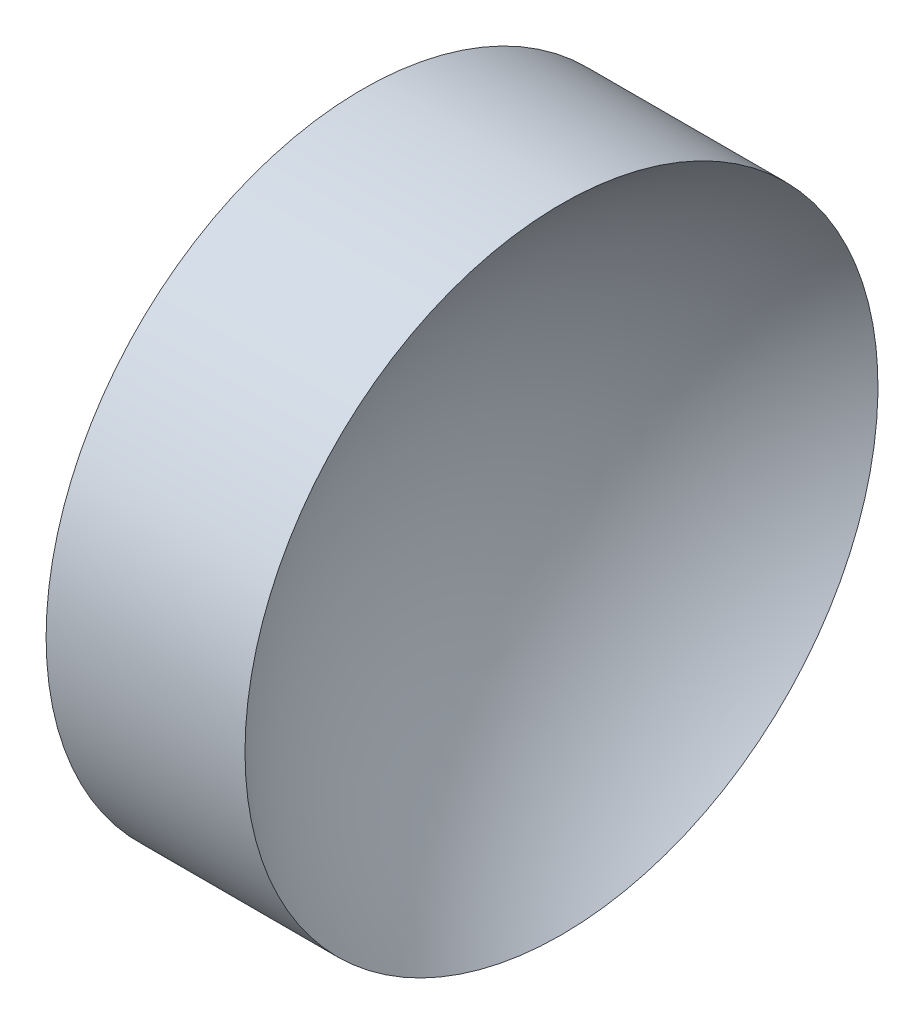
ISO-10303-21;
HEADER;
FILE_DESCRIPTION(('STEP AP214'),'2;1');
FILE_NAME('part.step','',(''),(''),'','','');
FILE_SCHEMA(('AUTOMOTIVE_DESIGN { 1 0 10303 214 1 1 1 1 }'));
ENDSEC;
DATA;
#1=APPLICATION_CONTEXT('core data for automotive mechanical design processes');
#2=APPLICATION_PROTOCOL_DEFINITION('international standard','automotive_design',2000,#1);
#3=PRODUCT_CONTEXT('',#1,'mechanical');
#4=PRODUCT('Part','Part','',(#3));
#5=PRODUCT_RELATED_PRODUCT_CATEGORY('part','',(#4));
#6=PRODUCT_DEFINITION_FORMATION('','',#4);
#7=PRODUCT_DEFINITION_CONTEXT('part definition',#1,'design');
#8=PRODUCT_DEFINITION('design','',#6,#7);
#9=PRODUCT_DEFINITION_SHAPE('','',#8);
#10=(LENGTH_UNIT() NAMED_UNIT(*) SI_UNIT(.MILLI.,.METRE.));
#11=(NAMED_UNIT(*) PLANE_ANGLE_UNIT() SI_UNIT($,.RADIAN.));
#12=(NAMED_UNIT(*) SI_UNIT($,.STERADIAN.) SOLID_ANGLE_UNIT());
#13=UNCERTAINTY_MEASURE_WITH_UNIT(LENGTH_MEASURE(1.E-05),#10,'distance_accuracy_value','');
#14=(GEOMETRIC_REPRESENTATION_CONTEXT(3) GLOBAL_UNCERTAINTY_ASSIGNED_CONTEXT((#13)) GLOBAL_UNIT_ASSIGNED_CONTEXT((#10,
#11,#12)) REPRESENTATION_CONTEXT('',''));
#15=CARTESIAN_POINT('',(0.,0.,0.));
#16=DIRECTION('',(0.,0.,1.));
#17=DIRECTION('',(1.,0.,0.));
#18=AXIS2_PLACEMENT_3D('',#15,#16,#17);
#19=CARTESIAN_POINT('',(75.8023370525261,32.6107681292268,0.));
#20=DIRECTION('',(-1.,0.,0.));
#21=DIRECTION('',(0.,-1.,0.));
#22=AXIS2_PLACEMENT_3D('',#19,#20,#21);
#23=SPHERICAL_SURFACE('',#22,16.27);
#24=CARTESIAN_POINT('',(65.3877847337752,32.6107681292268,0.));
#25=DIRECTION('',(-1.,0.,0.));
#26=DIRECTION('',(0.,0.,1.));
#27=AXIS2_PLACEMENT_3D('',#24,#25,#26);
#28=CIRCLE('',#27,12.5);
#29=CARTESIAN_POINT('',(65.3877847337752,32.6107681292268,12.5));
#30=VERTEX_POINT('',#29);
#31=EDGE_CURVE('E10',#30,#30,#28,.T.);
#32=ORIENTED_EDGE('',*,*,#31,.F.);
#33=EDGE_LOOP('',(#32));
#34=FACE_BOUND('',#33,.T.);
#35=ADVANCED_FACE('F35',(#34),#23,.F.);
#36=CARTESIAN_POINT('',(56.1009150799972,32.6107681292268,0.));
#37=DIRECTION('',(-1.,0.,0.));
#38=DIRECTION('',(0.,0.,1.));
#39=AXIS2_PLACEMENT_3D('',#36,#37,#38);
#40=CYLINDRICAL_SURFACE('',#39,12.5);
#41=CARTESIAN_POINT('',(57.5323370525261,32.6107681292268,0.));
#42=DIRECTION('',(-1.,0.,0.));
#43=DIRECTION('',(0.,0.,1.));
#44=AXIS2_PLACEMENT_3D('',#41,#42,#43);
#45=CIRCLE('',#44,12.5);
#46=CARTESIAN_POINT('',(57.5323370525261,32.6107681292268,12.5));
#47=VERTEX_POINT('',#46);
#48=EDGE_CURVE('E41',#47,#47,#45,.T.);
#49=ORIENTED_EDGE('',*,*,#48,.F.);
#50=EDGE_LOOP('',(#49));
#51=FACE_BOUND('',#50,.T.);
#52=ORIENTED_EDGE('',*,*,#31,.T.);
#53=EDGE_LOOP('',(#52));
#54=FACE_BOUND('',#53,.T.);
#55=ADVANCED_FACE('F49',(#51,#54),#40,.T.);
#56=CARTESIAN_POINT('',(57.5323370525261,32.6107681292268,0.));
#57=DIRECTION('',(1.,0.,0.));
#58=DIRECTION('',(0.,0.,-1.));
#59=AXIS2_PLACEMENT_3D('',#56,#57,#58);
#60=PLANE('',#59);
#61=ORIENTED_EDGE('',*,*,#48,.T.);
#62=EDGE_LOOP('',(#61));
#63=FACE_BOUND('',#62,.T.);
#64=ADVANCED_FACE('F47',(#63),#60,.F.);
#65=CLOSED_SHELL('',(#35,#55,#64));
#66=MANIFOLD_SOLID_BREP('B2',#65);
#67=ADVANCED_BREP_SHAPE_REPRESENTATION('',(#18,#66),#14);
#68=SHAPE_DEFINITION_REPRESENTATION(#9,#67);
ENDSEC;
END-ISO-10303-21;
